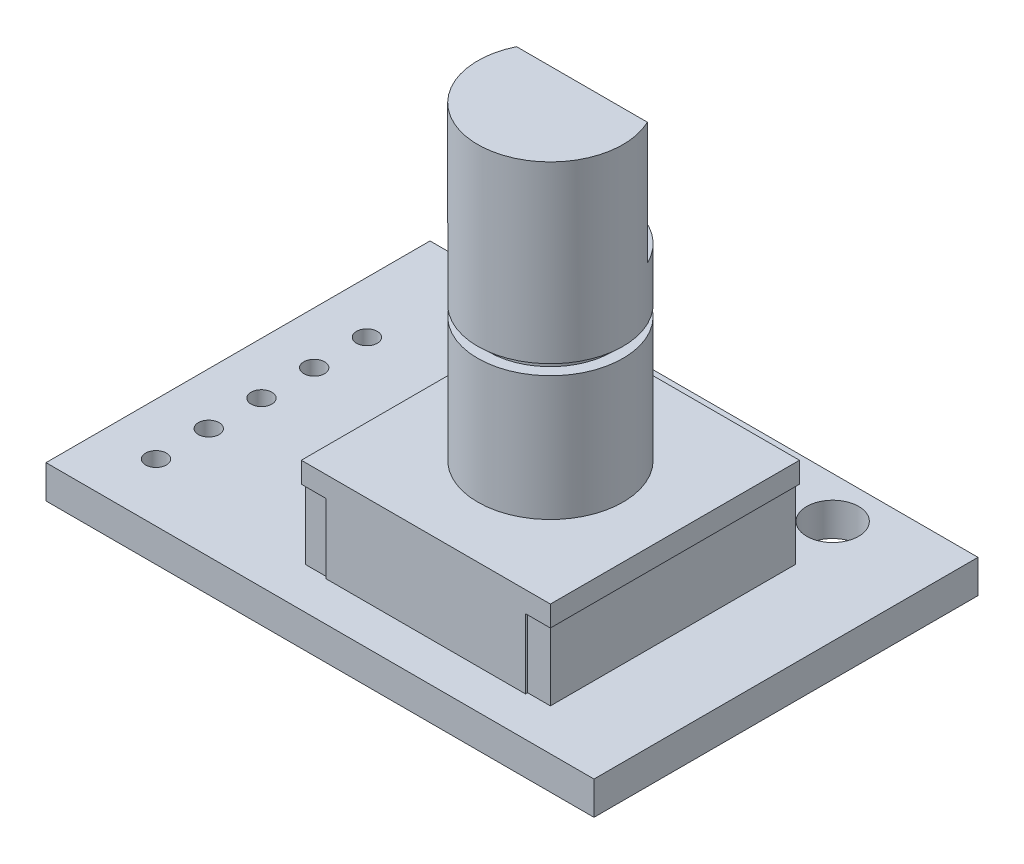
ISO-10303-21;
HEADER;
FILE_DESCRIPTION(('STEP AP214'),'2;1');
FILE_NAME('part.step','',(''),(''),'','','');
FILE_SCHEMA(('AUTOMOTIVE_DESIGN { 1 0 10303 214 1 1 1 1 }'));
ENDSEC;
DATA;
#1=APPLICATION_CONTEXT('core data for automotive mechanical design processes');
#2=APPLICATION_PROTOCOL_DEFINITION('international standard','automotive_design',2000,#1);
#3=PRODUCT_CONTEXT('',#1,'mechanical');
#4=PRODUCT('Part','Part','',(#3));
#5=PRODUCT_RELATED_PRODUCT_CATEGORY('part','',(#4));
#6=PRODUCT_DEFINITION_FORMATION('','',#4);
#7=PRODUCT_DEFINITION_CONTEXT('part definition',#1,'design');
#8=PRODUCT_DEFINITION('design','',#6,#7);
#9=PRODUCT_DEFINITION_SHAPE('','',#8);
#10=(LENGTH_UNIT() NAMED_UNIT(*) SI_UNIT(.MILLI.,.METRE.));
#11=(NAMED_UNIT(*) PLANE_ANGLE_UNIT() SI_UNIT($,.RADIAN.));
#12=(NAMED_UNIT(*) SI_UNIT($,.STERADIAN.) SOLID_ANGLE_UNIT());
#13=UNCERTAINTY_MEASURE_WITH_UNIT(LENGTH_MEASURE(1.E-05),#10,'distance_accuracy_value','');
#14=(GEOMETRIC_REPRESENTATION_CONTEXT(3) GLOBAL_UNCERTAINTY_ASSIGNED_CONTEXT((#13)) GLOBAL_UNIT_ASSIGNED_CONTEXT((#10,
#11,#12)) REPRESENTATION_CONTEXT('',''));
#15=CARTESIAN_POINT('',(0.,0.,0.));
#16=DIRECTION('',(0.,0.,1.));
#17=DIRECTION('',(1.,0.,0.));
#18=AXIS2_PLACEMENT_3D('',#15,#16,#17);
#19=CARTESIAN_POINT('',(9.19999999999999,5.95,7.35));
#20=DIRECTION('',(-1.,0.,0.));
#21=DIRECTION('',(0.,0.,1.));
#22=AXIS2_PLACEMENT_3D('',#19,#20,#21);
#23=PLANE('',#22);
#24=DIRECTION('',(0.,0.,-1.));
#25=VECTOR('',#24,1.);
#26=CARTESIAN_POINT('',(9.2,4.95,-4.65));
#27=LINE('',#26,#25);
#28=CARTESIAN_POINT('',(9.19999999999999,4.95,7.35));
#29=VERTEX_POINT('',#28);
#30=CARTESIAN_POINT('',(9.2,4.95,-4.65));
#31=VERTEX_POINT('',#30);
#32=EDGE_CURVE('E310',#29,#31,#27,.T.);
#33=ORIENTED_EDGE('',*,*,#32,.T.);
#34=DIRECTION('',(0.,-1.,0.));
#35=VECTOR('',#34,1.);
#36=CARTESIAN_POINT('',(9.2,5.95,-4.65));
#37=LINE('',#36,#35);
#38=CARTESIAN_POINT('',(9.2,5.95,-4.65));
#39=VERTEX_POINT('',#38);
#40=EDGE_CURVE('E400',#39,#31,#37,.T.);
#41=ORIENTED_EDGE('',*,*,#40,.F.);
#42=DIRECTION('',(0.,0.,-1.));
#43=VECTOR('',#42,1.);
#44=CARTESIAN_POINT('',(9.19999999999999,5.95,7.35));
#45=LINE('',#44,#43);
#46=CARTESIAN_POINT('',(9.19999999999999,5.95,7.35));
#47=VERTEX_POINT('',#46);
#48=EDGE_CURVE('E368',#47,#39,#45,.T.);
#49=ORIENTED_EDGE('',*,*,#48,.F.);
#50=DIRECTION('',(0.,-1.,0.));
#51=VECTOR('',#50,1.);
#52=CARTESIAN_POINT('',(9.19999999999999,5.95,7.35));
#53=LINE('',#52,#51);
#54=EDGE_CURVE('E382',#47,#29,#53,.T.);
#55=ORIENTED_EDGE('',*,*,#54,.T.);
#56=EDGE_LOOP('',(#33,#41,#49,#55));
#57=FACE_BOUND('',#56,.T.);
#58=ADVANCED_FACE('F41',(#57),#23,.F.);
#59=CARTESIAN_POINT('',(9.2,5.95,-4.65));
#60=DIRECTION('',(0.,0.,1.));
#61=DIRECTION('',(1.,0.,0.));
#62=AXIS2_PLACEMENT_3D('',#59,#60,#61);
#63=PLANE('',#62);
#64=DIRECTION('',(0.,-1.,0.));
#65=VECTOR('',#64,1.);
#66=CARTESIAN_POINT('',(-1.6,4.95,-4.65));
#67=LINE('',#66,#65);
#68=CARTESIAN_POINT('',(-1.6,4.95,-4.65));
#69=VERTEX_POINT('',#68);
#70=CARTESIAN_POINT('',(-1.6,1.6,-4.65));
#71=VERTEX_POINT('',#70);
#72=EDGE_CURVE('E302',#69,#71,#67,.T.);
#73=ORIENTED_EDGE('',*,*,#72,.F.);
#74=DIRECTION('',(-1.,0.,0.));
#75=VECTOR('',#74,1.);
#76=CARTESIAN_POINT('',(-1.6,4.95,-4.65));
#77=LINE('',#76,#75);
#78=CARTESIAN_POINT('',(-2.8,4.95,-4.65));
#79=VERTEX_POINT('',#78);
#80=EDGE_CURVE('E241',#69,#79,#77,.T.);
#81=ORIENTED_EDGE('',*,*,#80,.T.);
#82=DIRECTION('',(0.,-1.,0.));
#83=VECTOR('',#82,1.);
#84=CARTESIAN_POINT('',(-2.8,5.95,-4.65));
#85=LINE('',#84,#83);
#86=CARTESIAN_POINT('',(-2.8,5.95,-4.65));
#87=VERTEX_POINT('',#86);
#88=EDGE_CURVE('E396',#87,#79,#85,.T.);
#89=ORIENTED_EDGE('',*,*,#88,.F.);
#90=DIRECTION('',(-1.,0.,0.));
#91=VECTOR('',#90,1.);
#92=CARTESIAN_POINT('',(9.2,5.95,-4.65));
#93=LINE('',#92,#91);
#94=EDGE_CURVE('E372',#39,#87,#93,.T.);
#95=ORIENTED_EDGE('',*,*,#94,.F.);
#96=ORIENTED_EDGE('',*,*,#40,.T.);
#97=DIRECTION('',(-1.,0.,0.));
#98=VECTOR('',#97,1.);
#99=CARTESIAN_POINT('',(8.,4.95,-4.65));
#100=LINE('',#99,#98);
#101=CARTESIAN_POINT('',(8.,4.95,-4.65));
#102=VERTEX_POINT('',#101);
#103=EDGE_CURVE('E315',#31,#102,#100,.T.);
#104=ORIENTED_EDGE('',*,*,#103,.T.);
#105=DIRECTION('',(0.,-1.,0.));
#106=VECTOR('',#105,1.);
#107=CARTESIAN_POINT('',(8.,4.95,-4.65));
#108=LINE('',#107,#106);
#109=CARTESIAN_POINT('',(8.,1.6,-4.65));
#110=VERTEX_POINT('',#109);
#111=EDGE_CURVE('E272',#102,#110,#108,.T.);
#112=ORIENTED_EDGE('',*,*,#111,.T.);
#113=DIRECTION('',(-1.,0.,0.));
#114=VECTOR('',#113,1.);
#115=CARTESIAN_POINT('',(9.2,1.6,-4.65));
#116=LINE('',#115,#114);
#117=EDGE_CURVE('E305',#110,#71,#116,.T.);
#118=ORIENTED_EDGE('',*,*,#117,.T.);
#119=EDGE_LOOP('',(#73,#81,#89,#95,#96,#104,#112,#118));
#120=FACE_BOUND('',#119,.T.);
#121=ADVANCED_FACE('F530',(#120),#63,.F.);
#122=CARTESIAN_POINT('',(9.19999999999999,5.95,7.35));
#123=DIRECTION('',(0.,0.,-1.));
#124=DIRECTION('',(-1.,0.,0.));
#125=AXIS2_PLACEMENT_3D('',#122,#123,#124);
#126=PLANE('',#125);
#127=DIRECTION('',(0.,-1.,0.));
#128=VECTOR('',#127,1.);
#129=CARTESIAN_POINT('',(-1.6,4.95,7.35));
#130=LINE('',#129,#128);
#131=CARTESIAN_POINT('',(-1.6,4.95,7.35));
#132=VERTEX_POINT('',#131);
#133=CARTESIAN_POINT('',(-1.6,1.6,7.35));
#134=VERTEX_POINT('',#133);
#135=EDGE_CURVE('E298',#132,#134,#130,.T.);
#136=ORIENTED_EDGE('',*,*,#135,.T.);
#137=DIRECTION('',(1.,0.,0.));
#138=VECTOR('',#137,1.);
#139=CARTESIAN_POINT('',(9.19999999999999,1.6,7.35));
#140=LINE('',#139,#138);
#141=CARTESIAN_POINT('',(7.99999999999999,1.6,7.35));
#142=VERTEX_POINT('',#141);
#143=EDGE_CURVE('E373',#134,#142,#140,.T.);
#144=ORIENTED_EDGE('',*,*,#143,.T.);
#145=DIRECTION('',(0.,-1.,0.));
#146=VECTOR('',#145,1.);
#147=CARTESIAN_POINT('',(7.99999999999999,4.95,7.35));
#148=LINE('',#147,#146);
#149=CARTESIAN_POINT('',(7.99999999999999,4.95,7.35));
#150=VERTEX_POINT('',#149);
#151=EDGE_CURVE('E66',#150,#142,#148,.T.);
#152=ORIENTED_EDGE('',*,*,#151,.F.);
#153=DIRECTION('',(1.,0.,0.));
#154=VECTOR('',#153,1.);
#155=CARTESIAN_POINT('',(9.19999999999999,4.95,7.35));
#156=LINE('',#155,#154);
#157=EDGE_CURVE('E306',#150,#29,#156,.T.);
#158=ORIENTED_EDGE('',*,*,#157,.T.);
#159=ORIENTED_EDGE('',*,*,#54,.F.);
#160=DIRECTION('',(1.,0.,0.));
#161=VECTOR('',#160,1.);
#162=CARTESIAN_POINT('',(9.19999999999999,5.95,7.35));
#163=LINE('',#162,#161);
#164=CARTESIAN_POINT('',(-2.8,5.95,7.35));
#165=VERTEX_POINT('',#164);
#166=EDGE_CURVE('E379',#165,#47,#163,.T.);
#167=ORIENTED_EDGE('',*,*,#166,.F.);
#168=DIRECTION('',(0.,-1.,0.));
#169=VECTOR('',#168,1.);
#170=CARTESIAN_POINT('',(-2.8,5.95,7.35));
#171=LINE('',#170,#169);
#172=CARTESIAN_POINT('',(-2.8,4.95,7.35));
#173=VERTEX_POINT('',#172);
#174=EDGE_CURVE('E392',#165,#173,#171,.T.);
#175=ORIENTED_EDGE('',*,*,#174,.T.);
#176=DIRECTION('',(1.,0.,0.));
#177=VECTOR('',#176,1.);
#178=CARTESIAN_POINT('',(-2.8,4.95,7.35));
#179=LINE('',#178,#177);
#180=EDGE_CURVE('E250',#173,#132,#179,.T.);
#181=ORIENTED_EDGE('',*,*,#180,.T.);
#182=EDGE_LOOP('',(#136,#144,#152,#158,#159,#167,#175,#181));
#183=FACE_BOUND('',#182,.T.);
#184=ADVANCED_FACE('F521',(#183),#126,.F.);
#185=CARTESIAN_POINT('',(0.,1.6,0.));
#186=DIRECTION('',(0.,-1.,0.));
#187=DIRECTION('',(0.,0.,-1.));
#188=AXIS2_PLACEMENT_3D('',#185,#186,#187);
#189=PLANE('',#188);
#190=ORIENTED_EDGE('',*,*,#117,.F.);
#191=DIRECTION('',(0.,0.,1.));
#192=VECTOR('',#191,1.);
#193=CARTESIAN_POINT('',(8.,1.6,-4.55));
#194=LINE('',#193,#192);
#195=CARTESIAN_POINT('',(8.,1.6,-4.55));
#196=VERTEX_POINT('',#195);
#197=EDGE_CURVE('E233',#110,#196,#194,.T.);
#198=ORIENTED_EDGE('',*,*,#197,.T.);
#199=DIRECTION('',(1.,0.,0.));
#200=VECTOR('',#199,1.);
#201=CARTESIAN_POINT('',(9.1,1.6,-4.55));
#202=LINE('',#201,#200);
#203=CARTESIAN_POINT('',(9.1,1.6,-4.55));
#204=VERTEX_POINT('',#203);
#205=EDGE_CURVE('E336',#196,#204,#202,.T.);
#206=ORIENTED_EDGE('',*,*,#205,.T.);
#207=DIRECTION('',(0.,0.,1.));
#208=VECTOR('',#207,1.);
#209=CARTESIAN_POINT('',(9.09999999999999,1.6,7.25));
#210=LINE('',#209,#208);
#211=CARTESIAN_POINT('',(9.09999999999999,1.6,7.25));
#212=VERTEX_POINT('',#211);
#213=EDGE_CURVE('E339',#204,#212,#210,.T.);
#214=ORIENTED_EDGE('',*,*,#213,.T.);
#215=DIRECTION('',(-1.,0.,0.));
#216=VECTOR('',#215,1.);
#217=CARTESIAN_POINT('',(7.99999999999999,1.6,7.25));
#218=LINE('',#217,#216);
#219=CARTESIAN_POINT('',(7.99999999999999,1.6,7.25));
#220=VERTEX_POINT('',#219);
#221=EDGE_CURVE('E342',#212,#220,#218,.T.);
#222=ORIENTED_EDGE('',*,*,#221,.T.);
#223=DIRECTION('',(0.,0.,1.));
#224=VECTOR('',#223,1.);
#225=CARTESIAN_POINT('',(7.99999999999999,1.6,7.35));
#226=LINE('',#225,#224);
#227=EDGE_CURVE('E311',#220,#142,#226,.T.);
#228=ORIENTED_EDGE('',*,*,#227,.T.);
#229=ORIENTED_EDGE('',*,*,#143,.F.);
#230=DIRECTION('',(0.,0.,-1.));
#231=VECTOR('',#230,1.);
#232=CARTESIAN_POINT('',(-1.6,1.6,7.35));
#233=LINE('',#232,#231);
#234=CARTESIAN_POINT('',(-1.6,1.6,7.25));
#235=VERTEX_POINT('',#234);
#236=EDGE_CURVE('E271',#134,#235,#233,.T.);
#237=ORIENTED_EDGE('',*,*,#236,.T.);
#238=DIRECTION('',(-1.,0.,0.));
#239=VECTOR('',#238,1.);
#240=CARTESIAN_POINT('',(-1.6,1.6,7.25));
#241=LINE('',#240,#239);
#242=CARTESIAN_POINT('',(-2.7,1.6,7.25));
#243=VERTEX_POINT('',#242);
#244=EDGE_CURVE('E275',#235,#243,#241,.T.);
#245=ORIENTED_EDGE('',*,*,#244,.T.);
#246=DIRECTION('',(0.,0.,-1.));
#247=VECTOR('',#246,1.);
#248=CARTESIAN_POINT('',(-2.7,1.6,7.25));
#249=LINE('',#248,#247);
#250=CARTESIAN_POINT('',(-2.7,1.6,-4.55));
#251=VERTEX_POINT('',#250);
#252=EDGE_CURVE('E278',#243,#251,#249,.T.);
#253=ORIENTED_EDGE('',*,*,#252,.T.);
#254=DIRECTION('',(1.,0.,0.));
#255=VECTOR('',#254,1.);
#256=CARTESIAN_POINT('',(-2.7,1.6,-4.55));
#257=LINE('',#256,#255);
#258=CARTESIAN_POINT('',(-1.6,1.6,-4.55));
#259=VERTEX_POINT('',#258);
#260=EDGE_CURVE('E242',#251,#259,#257,.T.);
#261=ORIENTED_EDGE('',*,*,#260,.T.);
#262=DIRECTION('',(0.,0.,-1.));
#263=VECTOR('',#262,1.);
#264=CARTESIAN_POINT('',(-1.6,1.6,-4.55));
#265=LINE('',#264,#263);
#266=EDGE_CURVE('E267',#259,#71,#265,.T.);
#267=ORIENTED_EDGE('',*,*,#266,.T.);
#268=EDGE_LOOP('',(#190,#198,#206,#214,#222,#228,#229,#237,#245,#253,#261,#267));
#269=FACE_BOUND('',#268,.T.);
#270=CARTESIAN_POINT('',(-10.7,1.6,-3.71));
#271=DIRECTION('',(0.,1.,0.));
#272=DIRECTION('',(0.,0.,1.));
#273=AXIS2_PLACEMENT_3D('',#270,#271,#272);
#274=CIRCLE('',#273,0.500000000000001);
#275=CARTESIAN_POINT('',(-10.7,1.6,-3.21));
#276=VERTEX_POINT('',#275);
#277=EDGE_CURVE('E405',#276,#276,#274,.T.);
#278=ORIENTED_EDGE('',*,*,#277,.F.);
#279=EDGE_LOOP('',(#278));
#280=FACE_BOUND('',#279,.T.);
#281=CARTESIAN_POINT('',(-10.7,1.6,-1.17));
#282=DIRECTION('',(0.,1.,0.));
#283=DIRECTION('',(0.,0.,1.));
#284=AXIS2_PLACEMENT_3D('',#281,#282,#283);
#285=CIRCLE('',#284,0.500000000000001);
#286=CARTESIAN_POINT('',(-10.7,1.6,-0.669999999999998));
#287=VERTEX_POINT('',#286);
#288=EDGE_CURVE('E413',#287,#287,#285,.T.);
#289=ORIENTED_EDGE('',*,*,#288,.F.);
#290=EDGE_LOOP('',(#289));
#291=FACE_BOUND('',#290,.T.);
#292=CARTESIAN_POINT('',(-10.7,1.6,1.37));
#293=DIRECTION('',(0.,1.,0.));
#294=DIRECTION('',(0.,0.,1.));
#295=AXIS2_PLACEMENT_3D('',#292,#293,#294);
#296=CIRCLE('',#295,0.500000000000001);
#297=CARTESIAN_POINT('',(-10.7,1.6,1.87));
#298=VERTEX_POINT('',#297);
#299=EDGE_CURVE('E421',#298,#298,#296,.T.);
#300=ORIENTED_EDGE('',*,*,#299,.F.);
#301=EDGE_LOOP('',(#300));
#302=FACE_BOUND('',#301,.T.);
#303=CARTESIAN_POINT('',(-10.7,1.6,3.91));
#304=DIRECTION('',(0.,1.,0.));
#305=DIRECTION('',(0.,0.,1.));
#306=AXIS2_PLACEMENT_3D('',#303,#304,#305);
#307=CIRCLE('',#306,0.500000000000001);
#308=CARTESIAN_POINT('',(-10.7,1.6,4.41));
#309=VERTEX_POINT('',#308);
#310=EDGE_CURVE('E429',#309,#309,#307,.T.);
#311=ORIENTED_EDGE('',*,*,#310,.F.);
#312=EDGE_LOOP('',(#311));
#313=FACE_BOUND('',#312,.T.);
#314=CARTESIAN_POINT('',(-10.7,1.6,6.45));
#315=DIRECTION('',(0.,1.,0.));
#316=DIRECTION('',(0.,0.,1.));
#317=AXIS2_PLACEMENT_3D('',#314,#315,#316);
#318=CIRCLE('',#317,0.500000000000001);
#319=CARTESIAN_POINT('',(-10.7,1.6,6.95));
#320=VERTEX_POINT('',#319);
#321=EDGE_CURVE('E437',#320,#320,#318,.T.);
#322=ORIENTED_EDGE('',*,*,#321,.F.);
#323=EDGE_LOOP('',(#322));
#324=FACE_BOUND('',#323,.T.);
#325=CARTESIAN_POINT('',(8.2,1.6,-7.25));
#326=DIRECTION('',(0.,1.,0.));
#327=DIRECTION('',(0.,0.,1.));
#328=AXIS2_PLACEMENT_3D('',#325,#326,#327);
#329=CIRCLE('',#328,1.25);
#330=CARTESIAN_POINT('',(8.2,1.6,-6.));
#331=VERTEX_POINT('',#330);
#332=EDGE_CURVE('E445',#331,#331,#329,.T.);
#333=ORIENTED_EDGE('',*,*,#332,.F.);
#334=EDGE_LOOP('',(#333));
#335=FACE_BOUND('',#334,.T.);
#336=CARTESIAN_POINT('',(-5.80000000000001,1.6,-7.25));
#337=DIRECTION('',(0.,1.,0.));
#338=DIRECTION('',(0.,0.,1.));
#339=AXIS2_PLACEMENT_3D('',#336,#337,#338);
#340=CIRCLE('',#339,1.25);
#341=CARTESIAN_POINT('',(-5.80000000000001,1.6,-6.));
#342=VERTEX_POINT('',#341);
#343=EDGE_CURVE('E453',#342,#342,#340,.T.);
#344=ORIENTED_EDGE('',*,*,#343,.F.);
#345=EDGE_LOOP('',(#344));
#346=FACE_BOUND('',#345,.T.);
#347=DIRECTION('',(0.,0.,-1.));
#348=VECTOR('',#347,1.);
#349=CARTESIAN_POINT('',(13.2,1.6,9.25));
#350=LINE('',#349,#348);
#351=CARTESIAN_POINT('',(13.2,1.6,9.25));
#352=VERTEX_POINT('',#351);
#353=CARTESIAN_POINT('',(13.2,1.6,-9.25));
#354=VERTEX_POINT('',#353);
#355=EDGE_CURVE('E461',#352,#354,#350,.T.);
#356=ORIENTED_EDGE('',*,*,#355,.T.);
#357=DIRECTION('',(-1.,0.,0.));
#358=VECTOR('',#357,1.);
#359=CARTESIAN_POINT('',(-13.2,1.6,-9.25));
#360=LINE('',#359,#358);
#361=CARTESIAN_POINT('',(-13.2,1.6,-9.25));
#362=VERTEX_POINT('',#361);
#363=EDGE_CURVE('E465',#354,#362,#360,.T.);
#364=ORIENTED_EDGE('',*,*,#363,.T.);
#365=DIRECTION('',(0.,0.,1.));
#366=VECTOR('',#365,1.);
#367=CARTESIAN_POINT('',(-13.2,1.6,9.25));
#368=LINE('',#367,#366);
#369=CARTESIAN_POINT('',(-13.2,1.6,9.25));
#370=VERTEX_POINT('',#369);
#371=EDGE_CURVE('E469',#362,#370,#368,.T.);
#372=ORIENTED_EDGE('',*,*,#371,.T.);
#373=DIRECTION('',(1.,0.,0.));
#374=VECTOR('',#373,1.);
#375=CARTESIAN_POINT('',(-13.2,1.6,9.25));
#376=LINE('',#375,#374);
#377=EDGE_CURVE('E472',#370,#352,#376,.T.);
#378=ORIENTED_EDGE('',*,*,#377,.T.);
#379=EDGE_LOOP('',(#356,#364,#372,#378));
#380=FACE_BOUND('',#379,.T.);
#381=ADVANCED_FACE('F519',(#269,#280,#291,#302,#313,#324,#335,#346,#380),#189,.F.);
#382=CARTESIAN_POINT('',(0.,0.,0.));
#383=DIRECTION('',(0.,-1.,0.));
#384=DIRECTION('',(0.,0.,-1.));
#385=AXIS2_PLACEMENT_3D('',#382,#383,#384);
#386=PLANE('',#385);
#387=CARTESIAN_POINT('',(-10.7,0.,-1.17));
#388=DIRECTION('',(0.,1.,0.));
#389=DIRECTION('',(0.,0.,1.));
#390=AXIS2_PLACEMENT_3D('',#387,#388,#389);
#391=CIRCLE('',#390,0.500000000000001);
#392=CARTESIAN_POINT('',(-10.7,0.,-0.669999999999998));
#393=VERTEX_POINT('',#392);
#394=EDGE_CURVE('E409',#393,#393,#391,.T.);
#395=ORIENTED_EDGE('',*,*,#394,.T.);
#396=EDGE_LOOP('',(#395));
#397=FACE_BOUND('',#396,.T.);
#398=CARTESIAN_POINT('',(-10.7,0.,3.91));
#399=DIRECTION('',(0.,1.,0.));
#400=DIRECTION('',(0.,0.,1.));
#401=AXIS2_PLACEMENT_3D('',#398,#399,#400);
#402=CIRCLE('',#401,0.500000000000001);
#403=CARTESIAN_POINT('',(-10.7,0.,4.41));
#404=VERTEX_POINT('',#403);
#405=EDGE_CURVE('E425',#404,#404,#402,.T.);
#406=ORIENTED_EDGE('',*,*,#405,.T.);
#407=EDGE_LOOP('',(#406));
#408=FACE_BOUND('',#407,.T.);
#409=CARTESIAN_POINT('',(8.2,0.,-7.25));
#410=DIRECTION('',(0.,1.,0.));
#411=DIRECTION('',(0.,0.,1.));
#412=AXIS2_PLACEMENT_3D('',#409,#410,#411);
#413=CIRCLE('',#412,1.25);
#414=CARTESIAN_POINT('',(8.2,0.,-6.));
#415=VERTEX_POINT('',#414);
#416=EDGE_CURVE('E441',#415,#415,#413,.T.);
#417=ORIENTED_EDGE('',*,*,#416,.T.);
#418=EDGE_LOOP('',(#417));
#419=FACE_BOUND('',#418,.T.);
#420=DIRECTION('',(0.,0.,-1.));
#421=VECTOR('',#420,1.);
#422=CARTESIAN_POINT('',(13.2,0.,9.25));
#423=LINE('',#422,#421);
#424=CARTESIAN_POINT('',(13.2,0.,9.25));
#425=VERTEX_POINT('',#424);
#426=CARTESIAN_POINT('',(13.2,0.,-9.25));
#427=VERTEX_POINT('',#426);
#428=EDGE_CURVE('E457',#425,#427,#423,.T.);
#429=ORIENTED_EDGE('',*,*,#428,.F.);
#430=DIRECTION('',(1.,0.,0.));
#431=VECTOR('',#430,1.);
#432=CARTESIAN_POINT('',(-13.2,0.,9.25));
#433=LINE('',#432,#431);
#434=CARTESIAN_POINT('',(-13.2,0.,9.25));
#435=VERTEX_POINT('',#434);
#436=EDGE_CURVE('E466',#435,#425,#433,.T.);
#437=ORIENTED_EDGE('',*,*,#436,.F.);
#438=DIRECTION('',(0.,0.,1.));
#439=VECTOR('',#438,1.);
#440=CARTESIAN_POINT('',(-13.2,0.,9.25));
#441=LINE('',#440,#439);
#442=CARTESIAN_POINT('',(-13.2,0.,-9.25));
#443=VERTEX_POINT('',#442);
#444=EDGE_CURVE('E482',#443,#435,#441,.T.);
#445=ORIENTED_EDGE('',*,*,#444,.F.);
#446=DIRECTION('',(-1.,0.,0.));
#447=VECTOR('',#446,1.);
#448=CARTESIAN_POINT('',(-13.2,0.,-9.25));
#449=LINE('',#448,#447);
#450=EDGE_CURVE('E479',#427,#443,#449,.T.);
#451=ORIENTED_EDGE('',*,*,#450,.F.);
#452=EDGE_LOOP('',(#429,#437,#445,#451));
#453=FACE_BOUND('',#452,.T.);
#454=CARTESIAN_POINT('',(-5.80000000000001,0.,-7.25));
#455=DIRECTION('',(0.,1.,0.));
#456=DIRECTION('',(0.,0.,1.));
#457=AXIS2_PLACEMENT_3D('',#454,#455,#456);
#458=CIRCLE('',#457,1.25);
#459=CARTESIAN_POINT('',(-5.80000000000001,0.,-6.));
#460=VERTEX_POINT('',#459);
#461=EDGE_CURVE('E449',#460,#460,#458,.T.);
#462=ORIENTED_EDGE('',*,*,#461,.T.);
#463=EDGE_LOOP('',(#462));
#464=FACE_BOUND('',#463,.T.);
#465=CARTESIAN_POINT('',(-10.7,0.,6.45));
#466=DIRECTION('',(0.,1.,0.));
#467=DIRECTION('',(0.,0.,1.));
#468=AXIS2_PLACEMENT_3D('',#465,#466,#467);
#469=CIRCLE('',#468,0.500000000000001);
#470=CARTESIAN_POINT('',(-10.7,0.,6.95));
#471=VERTEX_POINT('',#470);
#472=EDGE_CURVE('E433',#471,#471,#469,.T.);
#473=ORIENTED_EDGE('',*,*,#472,.T.);
#474=EDGE_LOOP('',(#473));
#475=FACE_BOUND('',#474,.T.);
#476=CARTESIAN_POINT('',(-10.7,0.,1.37));
#477=DIRECTION('',(0.,1.,0.));
#478=DIRECTION('',(0.,0.,1.));
#479=AXIS2_PLACEMENT_3D('',#476,#477,#478);
#480=CIRCLE('',#479,0.500000000000001);
#481=CARTESIAN_POINT('',(-10.7,0.,1.87));
#482=VERTEX_POINT('',#481);
#483=EDGE_CURVE('E417',#482,#482,#480,.T.);
#484=ORIENTED_EDGE('',*,*,#483,.T.);
#485=EDGE_LOOP('',(#484));
#486=FACE_BOUND('',#485,.T.);
#487=CARTESIAN_POINT('',(-10.7,0.,-3.71));
#488=DIRECTION('',(0.,1.,0.));
#489=DIRECTION('',(0.,0.,1.));
#490=AXIS2_PLACEMENT_3D('',#487,#488,#489);
#491=CIRCLE('',#490,0.500000000000001);
#492=CARTESIAN_POINT('',(-10.7,0.,-3.21));
#493=VERTEX_POINT('',#492);
#494=EDGE_CURVE('E404',#493,#493,#491,.T.);
#495=ORIENTED_EDGE('',*,*,#494,.T.);
#496=EDGE_LOOP('',(#495));
#497=FACE_BOUND('',#496,.T.);
#498=ADVANCED_FACE('F511',(#397,#408,#419,#453,#464,#475,#486,#497),#386,.T.);
#499=CARTESIAN_POINT('',(13.2,1.6,9.25));
#500=DIRECTION('',(-1.,0.,0.));
#501=DIRECTION('',(0.,0.,1.));
#502=AXIS2_PLACEMENT_3D('',#499,#500,#501);
#503=PLANE('',#502);
#504=ORIENTED_EDGE('',*,*,#428,.T.);
#505=DIRECTION('',(0.,-1.,0.));
#506=VECTOR('',#505,1.);
#507=CARTESIAN_POINT('',(13.2,1.6,-9.25));
#508=LINE('',#507,#506);
#509=EDGE_CURVE('E45',#354,#427,#508,.T.);
#510=ORIENTED_EDGE('',*,*,#509,.F.);
#511=ORIENTED_EDGE('',*,*,#355,.F.);
#512=DIRECTION('',(0.,-1.,0.));
#513=VECTOR('',#512,1.);
#514=CARTESIAN_POINT('',(13.2,1.6,9.25));
#515=LINE('',#514,#513);
#516=EDGE_CURVE('E475',#352,#425,#515,.T.);
#517=ORIENTED_EDGE('',*,*,#516,.T.);
#518=EDGE_LOOP('',(#504,#510,#511,#517));
#519=FACE_BOUND('',#518,.T.);
#520=ADVANCED_FACE('F43',(#519),#503,.F.);
#521=CARTESIAN_POINT('',(-13.2,1.6,-9.25));
#522=DIRECTION('',(0.,0.,1.));
#523=DIRECTION('',(1.,0.,0.));
#524=AXIS2_PLACEMENT_3D('',#521,#522,#523);
#525=PLANE('',#524);
#526=ORIENTED_EDGE('',*,*,#450,.T.);
#527=DIRECTION('',(0.,-1.,0.));
#528=VECTOR('',#527,1.);
#529=CARTESIAN_POINT('',(-13.2,1.6,-9.25));
#530=LINE('',#529,#528);
#531=EDGE_CURVE('E493',#362,#443,#530,.T.);
#532=ORIENTED_EDGE('',*,*,#531,.F.);
#533=ORIENTED_EDGE('',*,*,#363,.F.);
#534=ORIENTED_EDGE('',*,*,#509,.T.);
#535=EDGE_LOOP('',(#526,#532,#533,#534));
#536=FACE_BOUND('',#535,.T.);
#537=ADVANCED_FACE('F504',(#536),#525,.F.);
#538=CARTESIAN_POINT('',(-13.2,1.6,9.25));
#539=DIRECTION('',(1.,0.,0.));
#540=DIRECTION('',(0.,0.,-1.));
#541=AXIS2_PLACEMENT_3D('',#538,#539,#540);
#542=PLANE('',#541);
#543=ORIENTED_EDGE('',*,*,#444,.T.);
#544=DIRECTION('',(0.,-1.,0.));
#545=VECTOR('',#544,1.);
#546=CARTESIAN_POINT('',(-13.2,1.6,9.25));
#547=LINE('',#546,#545);
#548=EDGE_CURVE('E490',#370,#435,#547,.T.);
#549=ORIENTED_EDGE('',*,*,#548,.F.);
#550=ORIENTED_EDGE('',*,*,#371,.F.);
#551=ORIENTED_EDGE('',*,*,#531,.T.);
#552=EDGE_LOOP('',(#543,#549,#550,#551));
#553=FACE_BOUND('',#552,.T.);
#554=ADVANCED_FACE('F514',(#553),#542,.F.);
#555=CARTESIAN_POINT('',(-13.2,1.6,9.25));
#556=DIRECTION('',(0.,0.,-1.));
#557=DIRECTION('',(-1.,0.,0.));
#558=AXIS2_PLACEMENT_3D('',#555,#556,#557);
#559=PLANE('',#558);
#560=ORIENTED_EDGE('',*,*,#436,.T.);
#561=ORIENTED_EDGE('',*,*,#516,.F.);
#562=ORIENTED_EDGE('',*,*,#377,.F.);
#563=ORIENTED_EDGE('',*,*,#548,.T.);
#564=EDGE_LOOP('',(#560,#561,#562,#563));
#565=FACE_BOUND('',#564,.T.);
#566=ADVANCED_FACE('F517',(#565),#559,.F.);
#567=CARTESIAN_POINT('',(-5.80000000000001,1.6,-7.25));
#568=DIRECTION('',(0.,-1.,0.));
#569=DIRECTION('',(0.,0.,-1.));
#570=AXIS2_PLACEMENT_3D('',#567,#568,#569);
#571=CYLINDRICAL_SURFACE('',#570,1.25);
#572=ORIENTED_EDGE('',*,*,#343,.T.);
#573=EDGE_LOOP('',(#572));
#574=FACE_BOUND('',#573,.T.);
#575=ORIENTED_EDGE('',*,*,#461,.F.);
#576=EDGE_LOOP('',(#575));
#577=FACE_BOUND('',#576,.T.);
#578=ADVANCED_FACE('F569',(#574,#577),#571,.F.);
#579=CARTESIAN_POINT('',(8.2,1.6,-7.25));
#580=DIRECTION('',(0.,-1.,0.));
#581=DIRECTION('',(0.,0.,-1.));
#582=AXIS2_PLACEMENT_3D('',#579,#580,#581);
#583=CYLINDRICAL_SURFACE('',#582,1.25);
#584=ORIENTED_EDGE('',*,*,#332,.T.);
#585=EDGE_LOOP('',(#584));
#586=FACE_BOUND('',#585,.T.);
#587=ORIENTED_EDGE('',*,*,#416,.F.);
#588=EDGE_LOOP('',(#587));
#589=FACE_BOUND('',#588,.T.);
#590=ADVANCED_FACE('F566',(#586,#589),#583,.F.);
#591=CARTESIAN_POINT('',(-10.7,1.6,6.45));
#592=DIRECTION('',(0.,-1.,0.));
#593=DIRECTION('',(0.,0.,-1.));
#594=AXIS2_PLACEMENT_3D('',#591,#592,#593);
#595=CYLINDRICAL_SURFACE('',#594,0.500000000000001);
#596=ORIENTED_EDGE('',*,*,#321,.T.);
#597=EDGE_LOOP('',(#596));
#598=FACE_BOUND('',#597,.T.);
#599=ORIENTED_EDGE('',*,*,#472,.F.);
#600=EDGE_LOOP('',(#599));
#601=FACE_BOUND('',#600,.T.);
#602=ADVANCED_FACE('F562',(#598,#601),#595,.F.);
#603=CARTESIAN_POINT('',(-10.7,1.6,3.91));
#604=DIRECTION('',(0.,-1.,0.));
#605=DIRECTION('',(0.,0.,-1.));
#606=AXIS2_PLACEMENT_3D('',#603,#604,#605);
#607=CYLINDRICAL_SURFACE('',#606,0.500000000000001);
#608=ORIENTED_EDGE('',*,*,#310,.T.);
#609=EDGE_LOOP('',(#608));
#610=FACE_BOUND('',#609,.T.);
#611=ORIENTED_EDGE('',*,*,#405,.F.);
#612=EDGE_LOOP('',(#611));
#613=FACE_BOUND('',#612,.T.);
#614=ADVANCED_FACE('F558',(#610,#613),#607,.F.);
#615=CARTESIAN_POINT('',(-10.7,1.6,1.37));
#616=DIRECTION('',(0.,-1.,0.));
#617=DIRECTION('',(0.,0.,-1.));
#618=AXIS2_PLACEMENT_3D('',#615,#616,#617);
#619=CYLINDRICAL_SURFACE('',#618,0.500000000000001);
#620=ORIENTED_EDGE('',*,*,#299,.T.);
#621=EDGE_LOOP('',(#620));
#622=FACE_BOUND('',#621,.T.);
#623=ORIENTED_EDGE('',*,*,#483,.F.);
#624=EDGE_LOOP('',(#623));
#625=FACE_BOUND('',#624,.T.);
#626=ADVANCED_FACE('F554',(#622,#625),#619,.F.);
#627=CARTESIAN_POINT('',(-10.7,1.6,-1.17));
#628=DIRECTION('',(0.,-1.,0.));
#629=DIRECTION('',(0.,0.,-1.));
#630=AXIS2_PLACEMENT_3D('',#627,#628,#629);
#631=CYLINDRICAL_SURFACE('',#630,0.500000000000001);
#632=ORIENTED_EDGE('',*,*,#288,.T.);
#633=EDGE_LOOP('',(#632));
#634=FACE_BOUND('',#633,.T.);
#635=ORIENTED_EDGE('',*,*,#394,.F.);
#636=EDGE_LOOP('',(#635));
#637=FACE_BOUND('',#636,.T.);
#638=ADVANCED_FACE('F550',(#634,#637),#631,.F.);
#639=CARTESIAN_POINT('',(-10.7,1.6,-3.71));
#640=DIRECTION('',(0.,-1.,0.));
#641=DIRECTION('',(0.,0.,-1.));
#642=AXIS2_PLACEMENT_3D('',#639,#640,#641);
#643=CYLINDRICAL_SURFACE('',#642,0.500000000000001);
#644=ORIENTED_EDGE('',*,*,#277,.T.);
#645=EDGE_LOOP('',(#644));
#646=FACE_BOUND('',#645,.T.);
#647=ORIENTED_EDGE('',*,*,#494,.F.);
#648=EDGE_LOOP('',(#647));
#649=FACE_BOUND('',#648,.T.);
#650=ADVANCED_FACE('F546',(#646,#649),#643,.F.);
#651=CARTESIAN_POINT('',(-2.8,5.95,7.35));
#652=DIRECTION('',(1.,0.,0.));
#653=DIRECTION('',(0.,0.,-1.));
#654=AXIS2_PLACEMENT_3D('',#651,#652,#653);
#655=PLANE('',#654);
#656=ORIENTED_EDGE('',*,*,#88,.T.);
#657=DIRECTION('',(0.,0.,1.));
#658=VECTOR('',#657,1.);
#659=CARTESIAN_POINT('',(-2.8,4.95,-4.65));
#660=LINE('',#659,#658);
#661=EDGE_CURVE('E246',#79,#173,#660,.T.);
#662=ORIENTED_EDGE('',*,*,#661,.T.);
#663=ORIENTED_EDGE('',*,*,#174,.F.);
#664=DIRECTION('',(0.,0.,1.));
#665=VECTOR('',#664,1.);
#666=CARTESIAN_POINT('',(-2.8,5.95,7.35));
#667=LINE('',#666,#665);
#668=EDGE_CURVE('E376',#87,#165,#667,.T.);
#669=ORIENTED_EDGE('',*,*,#668,.F.);
#670=EDGE_LOOP('',(#656,#662,#663,#669));
#671=FACE_BOUND('',#670,.T.);
#672=ADVANCED_FACE('F549',(#671),#655,.F.);
#673=CARTESIAN_POINT('',(0.,5.95,0.));
#674=DIRECTION('',(0.,1.,0.));
#675=DIRECTION('',(0.,0.,1.));
#676=AXIS2_PLACEMENT_3D('',#673,#674,#675);
#677=PLANE('',#676);
#678=CARTESIAN_POINT('',(3.2,5.95,1.35));
#679=DIRECTION('',(0.,1.,0.));
#680=DIRECTION('',(0.,0.,1.));
#681=AXIS2_PLACEMENT_3D('',#678,#679,#680);
#682=CIRCLE('',#681,3.5);
#683=CARTESIAN_POINT('',(3.2,5.95,4.85));
#684=VERTEX_POINT('',#683);
#685=EDGE_CURVE('E51',#684,#684,#682,.T.);
#686=ORIENTED_EDGE('',*,*,#685,.F.);
#687=EDGE_LOOP('',(#686));
#688=FACE_BOUND('',#687,.T.);
#689=ORIENTED_EDGE('',*,*,#48,.T.);
#690=ORIENTED_EDGE('',*,*,#94,.T.);
#691=ORIENTED_EDGE('',*,*,#668,.T.);
#692=ORIENTED_EDGE('',*,*,#166,.T.);
#693=EDGE_LOOP('',(#689,#690,#691,#692));
#694=FACE_BOUND('',#693,.T.);
#695=ADVANCED_FACE('F622',(#688,#694),#677,.T.);
#696=CARTESIAN_POINT('',(8.,4.95,-4.55));
#697=DIRECTION('',(1.,0.,0.));
#698=DIRECTION('',(0.,0.,-1.));
#699=AXIS2_PLACEMENT_3D('',#696,#697,#698);
#700=PLANE('',#699);
#701=ORIENTED_EDGE('',*,*,#197,.F.);
#702=ORIENTED_EDGE('',*,*,#111,.F.);
#703=DIRECTION('',(0.,0.,1.));
#704=VECTOR('',#703,1.);
#705=CARTESIAN_POINT('',(8.,4.95,-4.55));
#706=LINE('',#705,#704);
#707=CARTESIAN_POINT('',(8.,4.95,-4.55));
#708=VERTEX_POINT('',#707);
#709=EDGE_CURVE('E319',#102,#708,#706,.T.);
#710=ORIENTED_EDGE('',*,*,#709,.T.);
#711=DIRECTION('',(0.,-1.,0.));
#712=VECTOR('',#711,1.);
#713=CARTESIAN_POINT('',(8.,4.95,-4.55));
#714=LINE('',#713,#712);
#715=EDGE_CURVE('E361',#708,#196,#714,.T.);
#716=ORIENTED_EDGE('',*,*,#715,.T.);
#717=EDGE_LOOP('',(#701,#702,#710,#716));
#718=FACE_BOUND('',#717,.T.);
#719=ADVANCED_FACE('F627',(#718),#700,.T.);
#720=CARTESIAN_POINT('',(9.1,4.95,-4.55));
#721=DIRECTION('',(0.,0.,-1.));
#722=DIRECTION('',(-1.,0.,0.));
#723=AXIS2_PLACEMENT_3D('',#720,#721,#722);
#724=PLANE('',#723);
#725=ORIENTED_EDGE('',*,*,#205,.F.);
#726=ORIENTED_EDGE('',*,*,#715,.F.);
#727=DIRECTION('',(1.,0.,0.));
#728=VECTOR('',#727,1.);
#729=CARTESIAN_POINT('',(9.1,4.95,-4.55));
#730=LINE('',#729,#728);
#731=CARTESIAN_POINT('',(9.1,4.95,-4.55));
#732=VERTEX_POINT('',#731);
#733=EDGE_CURVE('E322',#708,#732,#730,.T.);
#734=ORIENTED_EDGE('',*,*,#733,.T.);
#735=DIRECTION('',(0.,-1.,0.));
#736=VECTOR('',#735,1.);
#737=CARTESIAN_POINT('',(9.1,4.95,-4.55));
#738=LINE('',#737,#736);
#739=EDGE_CURVE('E357',#732,#204,#738,.T.);
#740=ORIENTED_EDGE('',*,*,#739,.T.);
#741=EDGE_LOOP('',(#725,#726,#734,#740));
#742=FACE_BOUND('',#741,.T.);
#743=ADVANCED_FACE('F732',(#742),#724,.T.);
#744=CARTESIAN_POINT('',(9.09999999999999,4.95,7.25));
#745=DIRECTION('',(1.,0.,0.));
#746=DIRECTION('',(0.,0.,-1.));
#747=AXIS2_PLACEMENT_3D('',#744,#745,#746);
#748=PLANE('',#747);
#749=ORIENTED_EDGE('',*,*,#213,.F.);
#750=ORIENTED_EDGE('',*,*,#739,.F.);
#751=DIRECTION('',(0.,0.,1.));
#752=VECTOR('',#751,1.);
#753=CARTESIAN_POINT('',(9.09999999999999,4.95,7.25));
#754=LINE('',#753,#752);
#755=CARTESIAN_POINT('',(9.09999999999999,4.95,7.25));
#756=VERTEX_POINT('',#755);
#757=EDGE_CURVE('E325',#732,#756,#754,.T.);
#758=ORIENTED_EDGE('',*,*,#757,.T.);
#759=DIRECTION('',(0.,-1.,0.));
#760=VECTOR('',#759,1.);
#761=CARTESIAN_POINT('',(9.09999999999999,4.95,7.25));
#762=LINE('',#761,#760);
#763=EDGE_CURVE('E353',#756,#212,#762,.T.);
#764=ORIENTED_EDGE('',*,*,#763,.T.);
#765=EDGE_LOOP('',(#749,#750,#758,#764));
#766=FACE_BOUND('',#765,.T.);
#767=ADVANCED_FACE('F737',(#766),#748,.T.);
#768=CARTESIAN_POINT('',(7.99999999999999,4.95,7.25));
#769=DIRECTION('',(0.,0.,1.));
#770=DIRECTION('',(1.,0.,0.));
#771=AXIS2_PLACEMENT_3D('',#768,#769,#770);
#772=PLANE('',#771);
#773=ORIENTED_EDGE('',*,*,#221,.F.);
#774=ORIENTED_EDGE('',*,*,#763,.F.);
#775=DIRECTION('',(-1.,0.,0.));
#776=VECTOR('',#775,1.);
#777=CARTESIAN_POINT('',(7.99999999999999,4.95,7.25));
#778=LINE('',#777,#776);
#779=CARTESIAN_POINT('',(7.99999999999999,4.95,7.25));
#780=VERTEX_POINT('',#779);
#781=EDGE_CURVE('E328',#756,#780,#778,.T.);
#782=ORIENTED_EDGE('',*,*,#781,.T.);
#783=DIRECTION('',(0.,-1.,0.));
#784=VECTOR('',#783,1.);
#785=CARTESIAN_POINT('',(7.99999999999999,4.95,7.25));
#786=LINE('',#785,#784);
#787=EDGE_CURVE('E349',#780,#220,#786,.T.);
#788=ORIENTED_EDGE('',*,*,#787,.T.);
#789=EDGE_LOOP('',(#773,#774,#782,#788));
#790=FACE_BOUND('',#789,.T.);
#791=ADVANCED_FACE('F747',(#790),#772,.T.);
#792=CARTESIAN_POINT('',(7.99999999999999,4.95,7.35));
#793=DIRECTION('',(1.,0.,0.));
#794=DIRECTION('',(0.,0.,-1.));
#795=AXIS2_PLACEMENT_3D('',#792,#793,#794);
#796=PLANE('',#795);
#797=ORIENTED_EDGE('',*,*,#227,.F.);
#798=ORIENTED_EDGE('',*,*,#787,.F.);
#799=DIRECTION('',(0.,0.,1.));
#800=VECTOR('',#799,1.);
#801=CARTESIAN_POINT('',(7.99999999999999,4.95,7.35));
#802=LINE('',#801,#800);
#803=EDGE_CURVE('E331',#780,#150,#802,.T.);
#804=ORIENTED_EDGE('',*,*,#803,.T.);
#805=ORIENTED_EDGE('',*,*,#151,.T.);
#806=EDGE_LOOP('',(#797,#798,#804,#805));
#807=FACE_BOUND('',#806,.T.);
#808=ADVANCED_FACE('F756',(#807),#796,.T.);
#809=CARTESIAN_POINT('',(0.,4.95,0.));
#810=DIRECTION('',(0.,-1.,0.));
#811=DIRECTION('',(0.,0.,-1.));
#812=AXIS2_PLACEMENT_3D('',#809,#810,#811);
#813=PLANE('',#812);
#814=ORIENTED_EDGE('',*,*,#157,.F.);
#815=ORIENTED_EDGE('',*,*,#803,.F.);
#816=ORIENTED_EDGE('',*,*,#781,.F.);
#817=ORIENTED_EDGE('',*,*,#757,.F.);
#818=ORIENTED_EDGE('',*,*,#733,.F.);
#819=ORIENTED_EDGE('',*,*,#709,.F.);
#820=ORIENTED_EDGE('',*,*,#103,.F.);
#821=ORIENTED_EDGE('',*,*,#32,.F.);
#822=EDGE_LOOP('',(#814,#815,#816,#817,#818,#819,#820,#821));
#823=FACE_BOUND('',#822,.T.);
#824=ADVANCED_FACE('F766',(#823),#813,.T.);
#825=CARTESIAN_POINT('',(-1.6,4.95,-4.55));
#826=DIRECTION('',(-1.,0.,0.));
#827=DIRECTION('',(0.,0.,1.));
#828=AXIS2_PLACEMENT_3D('',#825,#826,#827);
#829=PLANE('',#828);
#830=ORIENTED_EDGE('',*,*,#266,.F.);
#831=DIRECTION('',(0.,-1.,0.));
#832=VECTOR('',#831,1.);
#833=CARTESIAN_POINT('',(-1.6,4.95,-4.55));
#834=LINE('',#833,#832);
#835=CARTESIAN_POINT('',(-1.6,4.95,-4.55));
#836=VERTEX_POINT('',#835);
#837=EDGE_CURVE('E266',#836,#259,#834,.T.);
#838=ORIENTED_EDGE('',*,*,#837,.F.);
#839=DIRECTION('',(0.,0.,-1.));
#840=VECTOR('',#839,1.);
#841=CARTESIAN_POINT('',(-1.6,4.95,-4.55));
#842=LINE('',#841,#840);
#843=EDGE_CURVE('E237',#836,#69,#842,.T.);
#844=ORIENTED_EDGE('',*,*,#843,.T.);
#845=ORIENTED_EDGE('',*,*,#72,.T.);
#846=EDGE_LOOP('',(#830,#838,#844,#845));
#847=FACE_BOUND('',#846,.T.);
#848=ADVANCED_FACE('F773',(#847),#829,.T.);
#849=CARTESIAN_POINT('',(-1.6,4.95,7.35));
#850=DIRECTION('',(-1.,0.,0.));
#851=DIRECTION('',(0.,0.,1.));
#852=AXIS2_PLACEMENT_3D('',#849,#850,#851);
#853=PLANE('',#852);
#854=ORIENTED_EDGE('',*,*,#236,.F.);
#855=ORIENTED_EDGE('',*,*,#135,.F.);
#856=DIRECTION('',(0.,0.,-1.));
#857=VECTOR('',#856,1.);
#858=CARTESIAN_POINT('',(-1.6,4.95,7.35));
#859=LINE('',#858,#857);
#860=CARTESIAN_POINT('',(-1.6,4.95,7.25));
#861=VERTEX_POINT('',#860);
#862=EDGE_CURVE('E254',#132,#861,#859,.T.);
#863=ORIENTED_EDGE('',*,*,#862,.T.);
#864=DIRECTION('',(0.,-1.,0.));
#865=VECTOR('',#864,1.);
#866=CARTESIAN_POINT('',(-1.6,4.95,7.25));
#867=LINE('',#866,#865);
#868=EDGE_CURVE('E294',#861,#235,#867,.T.);
#869=ORIENTED_EDGE('',*,*,#868,.T.);
#870=EDGE_LOOP('',(#854,#855,#863,#869));
#871=FACE_BOUND('',#870,.T.);
#872=ADVANCED_FACE('F717',(#871),#853,.T.);
#873=CARTESIAN_POINT('',(-1.6,4.95,7.25));
#874=DIRECTION('',(0.,0.,1.));
#875=DIRECTION('',(1.,0.,0.));
#876=AXIS2_PLACEMENT_3D('',#873,#874,#875);
#877=PLANE('',#876);
#878=ORIENTED_EDGE('',*,*,#244,.F.);
#879=ORIENTED_EDGE('',*,*,#868,.F.);
#880=DIRECTION('',(-1.,0.,0.));
#881=VECTOR('',#880,1.);
#882=CARTESIAN_POINT('',(-1.6,4.95,7.25));
#883=LINE('',#882,#881);
#884=CARTESIAN_POINT('',(-2.7,4.95,7.25));
#885=VERTEX_POINT('',#884);
#886=EDGE_CURVE('E257',#861,#885,#883,.T.);
#887=ORIENTED_EDGE('',*,*,#886,.T.);
#888=DIRECTION('',(0.,-1.,0.));
#889=VECTOR('',#888,1.);
#890=CARTESIAN_POINT('',(-2.7,4.95,7.25));
#891=LINE('',#890,#889);
#892=EDGE_CURVE('E290',#885,#243,#891,.T.);
#893=ORIENTED_EDGE('',*,*,#892,.T.);
#894=EDGE_LOOP('',(#878,#879,#887,#893));
#895=FACE_BOUND('',#894,.T.);
#896=ADVANCED_FACE('F705',(#895),#877,.T.);
#897=CARTESIAN_POINT('',(-2.7,4.95,7.25));
#898=DIRECTION('',(-1.,0.,0.));
#899=DIRECTION('',(0.,0.,1.));
#900=AXIS2_PLACEMENT_3D('',#897,#898,#899);
#901=PLANE('',#900);
#902=ORIENTED_EDGE('',*,*,#252,.F.);
#903=ORIENTED_EDGE('',*,*,#892,.F.);
#904=DIRECTION('',(0.,0.,-1.));
#905=VECTOR('',#904,1.);
#906=CARTESIAN_POINT('',(-2.7,4.95,7.25));
#907=LINE('',#906,#905);
#908=CARTESIAN_POINT('',(-2.7,4.95,-4.55));
#909=VERTEX_POINT('',#908);
#910=EDGE_CURVE('E260',#885,#909,#907,.T.);
#911=ORIENTED_EDGE('',*,*,#910,.T.);
#912=DIRECTION('',(0.,-1.,0.));
#913=VECTOR('',#912,1.);
#914=CARTESIAN_POINT('',(-2.7,4.95,-4.55));
#915=LINE('',#914,#913);
#916=EDGE_CURVE('E286',#909,#251,#915,.T.);
#917=ORIENTED_EDGE('',*,*,#916,.T.);
#918=EDGE_LOOP('',(#902,#903,#911,#917));
#919=FACE_BOUND('',#918,.T.);
#920=ADVANCED_FACE('F699',(#919),#901,.T.);
#921=CARTESIAN_POINT('',(-2.7,4.95,-4.55));
#922=DIRECTION('',(0.,0.,-1.));
#923=DIRECTION('',(-1.,0.,0.));
#924=AXIS2_PLACEMENT_3D('',#921,#922,#923);
#925=PLANE('',#924);
#926=ORIENTED_EDGE('',*,*,#260,.F.);
#927=ORIENTED_EDGE('',*,*,#916,.F.);
#928=DIRECTION('',(1.,0.,0.));
#929=VECTOR('',#928,1.);
#930=CARTESIAN_POINT('',(-2.7,4.95,-4.55));
#931=LINE('',#930,#929);
#932=EDGE_CURVE('E263',#909,#836,#931,.T.);
#933=ORIENTED_EDGE('',*,*,#932,.T.);
#934=ORIENTED_EDGE('',*,*,#837,.T.);
#935=EDGE_LOOP('',(#926,#927,#933,#934));
#936=FACE_BOUND('',#935,.T.);
#937=ADVANCED_FACE('F704',(#936),#925,.T.);
#938=CARTESIAN_POINT('',(0.,4.95,0.));
#939=DIRECTION('',(0.,1.,0.));
#940=DIRECTION('',(0.,0.,1.));
#941=AXIS2_PLACEMENT_3D('',#938,#939,#940);
#942=PLANE('',#941);
#943=ORIENTED_EDGE('',*,*,#843,.F.);
#944=ORIENTED_EDGE('',*,*,#932,.F.);
#945=ORIENTED_EDGE('',*,*,#910,.F.);
#946=ORIENTED_EDGE('',*,*,#886,.F.);
#947=ORIENTED_EDGE('',*,*,#862,.F.);
#948=ORIENTED_EDGE('',*,*,#180,.F.);
#949=ORIENTED_EDGE('',*,*,#661,.F.);
#950=ORIENTED_EDGE('',*,*,#80,.F.);
#951=EDGE_LOOP('',(#943,#944,#945,#946,#947,#948,#949,#950));
#952=FACE_BOUND('',#951,.T.);
#953=ADVANCED_FACE('F642',(#952),#942,.F.);
#954=CARTESIAN_POINT('',(3.2,11.95,1.35));
#955=DIRECTION('',(0.,-1.,0.));
#956=DIRECTION('',(0.,0.,-1.));
#957=AXIS2_PLACEMENT_3D('',#954,#955,#956);
#958=CYLINDRICAL_SURFACE('',#957,3.5);
#959=CARTESIAN_POINT('',(3.2,11.95,1.35));
#960=DIRECTION('',(0.,1.,0.));
#961=DIRECTION('',(0.,0.,1.));
#962=AXIS2_PLACEMENT_3D('',#959,#960,#961);
#963=CIRCLE('',#962,3.5);
#964=CARTESIAN_POINT('',(3.2,11.95,4.85));
#965=VERTEX_POINT('',#964);
#966=EDGE_CURVE('E228',#965,#965,#963,.T.);
#967=ORIENTED_EDGE('',*,*,#966,.F.);
#968=EDGE_LOOP('',(#967));
#969=FACE_BOUND('',#968,.T.);
#970=ORIENTED_EDGE('',*,*,#685,.T.);
#971=EDGE_LOOP('',(#970));
#972=FACE_BOUND('',#971,.T.);
#973=ADVANCED_FACE('F637',(#969,#972),#958,.T.);
#974=CARTESIAN_POINT('',(3.2,11.95,1.35));
#975=DIRECTION('',(0.,1.,0.));
#976=DIRECTION('',(0.,0.,1.));
#977=AXIS2_PLACEMENT_3D('',#974,#975,#976);
#978=PLANE('',#977);
#979=CARTESIAN_POINT('',(3.2,11.95,1.35));
#980=DIRECTION('',(0.,1.,0.));
#981=DIRECTION('',(0.,0.,1.));
#982=AXIS2_PLACEMENT_3D('',#979,#980,#981);
#983=CIRCLE('',#982,2.96709438119775);
#984=CARTESIAN_POINT('',(3.2,11.95,4.31709438119775));
#985=VERTEX_POINT('',#984);
#986=EDGE_CURVE('E11',#985,#985,#983,.T.);
#987=ORIENTED_EDGE('',*,*,#986,.F.);
#988=EDGE_LOOP('',(#987));
#989=FACE_BOUND('',#988,.T.);
#990=ORIENTED_EDGE('',*,*,#966,.T.);
#991=EDGE_LOOP('',(#990));
#992=FACE_BOUND('',#991,.T.);
#993=ADVANCED_FACE('F641',(#989,#992),#978,.T.);
#994=CARTESIAN_POINT('',(3.2,12.45,1.35));
#995=DIRECTION('',(0.,-1.,0.));
#996=DIRECTION('',(0.,0.,-1.));
#997=AXIS2_PLACEMENT_3D('',#994,#995,#996);
#998=CYLINDRICAL_SURFACE('',#997,2.96709438119775);
#999=CARTESIAN_POINT('',(3.2,12.45,1.35));
#1000=DIRECTION('',(0.,1.,0.));
#1001=DIRECTION('',(0.,0.,1.));
#1002=AXIS2_PLACEMENT_3D('',#999,#1000,#1001);
#1003=CIRCLE('',#1002,2.96709438119775);
#1004=CARTESIAN_POINT('',(3.2,12.45,4.31709438119775));
#1005=VERTEX_POINT('',#1004);
#1006=EDGE_CURVE('E224',#1005,#1005,#1003,.T.);
#1007=ORIENTED_EDGE('',*,*,#1006,.F.);
#1008=EDGE_LOOP('',(#1007));
#1009=FACE_BOUND('',#1008,.T.);
#1010=ORIENTED_EDGE('',*,*,#986,.T.);
#1011=EDGE_LOOP('',(#1010));
#1012=FACE_BOUND('',#1011,.T.);
#1013=ADVANCED_FACE('F656',(#1009,#1012),#998,.T.);
#1014=CARTESIAN_POINT('',(3.2,14.99,1.35));
#1015=DIRECTION('',(0.,-1.,0.));
#1016=DIRECTION('',(0.,0.,-1.));
#1017=AXIS2_PLACEMENT_3D('',#1014,#1015,#1016);
#1018=CYLINDRICAL_SURFACE('',#1017,3.5);
#1019=CARTESIAN_POINT('',(3.2,14.99,1.35));
#1020=DIRECTION('',(0.,1.,0.));
#1021=DIRECTION('',(0.,0.,1.));
#1022=AXIS2_PLACEMENT_3D('',#1019,#1020,#1021);
#1023=CIRCLE('',#1022,3.5);
#1024=CARTESIAN_POINT('',(6.35271311730071,14.99,-0.169999999999998));
#1025=VERTEX_POINT('',#1024);
#1026=CARTESIAN_POINT('',(0.0472868826992771,14.99,-0.169999999999999));
#1027=VERTEX_POINT('',#1026);
#1028=EDGE_CURVE('E212',#1025,#1027,#1023,.T.);
#1029=ORIENTED_EDGE('',*,*,#1028,.F.);
#1030=DIRECTION('',(0.,-1.,0.));
#1031=VECTOR('',#1030,1.);
#1032=CARTESIAN_POINT('',(6.35271311730072,20.87,-0.169999999999998));
#1033=LINE('',#1032,#1031);
#1034=CARTESIAN_POINT('',(6.35271311730072,20.87,-0.169999999999998));
#1035=VERTEX_POINT('',#1034);
#1036=EDGE_CURVE('E198',#1035,#1025,#1033,.T.);
#1037=ORIENTED_EDGE('',*,*,#1036,.F.);
#1038=CARTESIAN_POINT('',(3.2,20.87,1.35));
#1039=DIRECTION('',(0.,1.,0.));
#1040=DIRECTION('',(0.,0.,1.));
#1041=AXIS2_PLACEMENT_3D('',#1038,#1039,#1040);
#1042=CIRCLE('',#1041,3.5);
#1043=CARTESIAN_POINT('',(0.0472868826992771,20.87,-0.169999999999999));
#1044=VERTEX_POINT('',#1043);
#1045=EDGE_CURVE('E204',#1044,#1035,#1042,.T.);
#1046=ORIENTED_EDGE('',*,*,#1045,.F.);
#1047=DIRECTION('',(0.,-1.,0.));
#1048=VECTOR('',#1047,1.);
#1049=CARTESIAN_POINT('',(0.0472868826992771,20.87,-0.169999999999999));
#1050=LINE('',#1049,#1048);
#1051=EDGE_CURVE('E200',#1044,#1027,#1050,.T.);
#1052=ORIENTED_EDGE('',*,*,#1051,.T.);
#1053=EDGE_LOOP('',(#1029,#1037,#1046,#1052));
#1054=FACE_BOUND('',#1053,.T.);
#1055=CARTESIAN_POINT('',(3.2,12.45,1.35));
#1056=DIRECTION('',(0.,1.,0.));
#1057=DIRECTION('',(0.,0.,1.));
#1058=AXIS2_PLACEMENT_3D('',#1055,#1056,#1057);
#1059=CIRCLE('',#1058,3.5);
#1060=CARTESIAN_POINT('',(3.2,12.45,4.85));
#1061=VERTEX_POINT('',#1060);
#1062=EDGE_CURVE('E214',#1061,#1061,#1059,.T.);
#1063=ORIENTED_EDGE('',*,*,#1062,.T.);
#1064=EDGE_LOOP('',(#1063));
#1065=FACE_BOUND('',#1064,.T.);
#1066=ADVANCED_FACE('F210',(#1054,#1065),#1018,.T.);
#1067=CARTESIAN_POINT('',(3.2,14.99,1.35));
#1068=DIRECTION('',(0.,1.,0.));
#1069=DIRECTION('',(0.,0.,1.));
#1070=AXIS2_PLACEMENT_3D('',#1067,#1068,#1069);
#1071=PLANE('',#1070);
#1072=DIRECTION('',(-1.,0.,0.));
#1073=VECTOR('',#1072,1.);
#1074=CARTESIAN_POINT('',(0.0472868826992771,14.99,-0.169999999999999));
#1075=LINE('',#1074,#1073);
#1076=EDGE_CURVE('E58',#1025,#1027,#1075,.T.);
#1077=ORIENTED_EDGE('',*,*,#1076,.F.);
#1078=ORIENTED_EDGE('',*,*,#1028,.T.);
#1079=EDGE_LOOP('',(#1077,#1078));
#1080=FACE_BOUND('',#1079,.T.);
#1081=ADVANCED_FACE('F655',(#1080),#1071,.T.);
#1082=CARTESIAN_POINT('',(3.2,12.45,1.35));
#1083=DIRECTION('',(0.,1.,0.));
#1084=DIRECTION('',(0.,0.,1.));
#1085=AXIS2_PLACEMENT_3D('',#1082,#1083,#1084);
#1086=PLANE('',#1085);
#1087=ORIENTED_EDGE('',*,*,#1006,.T.);
#1088=EDGE_LOOP('',(#1087));
#1089=FACE_BOUND('',#1088,.T.);
#1090=ORIENTED_EDGE('',*,*,#1062,.F.);
#1091=EDGE_LOOP('',(#1090));
#1092=FACE_BOUND('',#1091,.T.);
#1093=ADVANCED_FACE('F669',(#1089,#1092),#1086,.F.);
#1094=CARTESIAN_POINT('',(0.0472868826992771,20.87,-0.169999999999999));
#1095=DIRECTION('',(0.,0.,1.));
#1096=DIRECTION('',(1.,0.,0.));
#1097=AXIS2_PLACEMENT_3D('',#1094,#1095,#1096);
#1098=PLANE('',#1097);
#1099=ORIENTED_EDGE('',*,*,#1076,.T.);
#1100=ORIENTED_EDGE('',*,*,#1051,.F.);
#1101=DIRECTION('',(-1.,0.,0.));
#1102=VECTOR('',#1101,1.);
#1103=CARTESIAN_POINT('',(0.0472868826992771,20.87,-0.169999999999999));
#1104=LINE('',#1103,#1102);
#1105=EDGE_CURVE('E194',#1035,#1044,#1104,.T.);
#1106=ORIENTED_EDGE('',*,*,#1105,.F.);
#1107=ORIENTED_EDGE('',*,*,#1036,.T.);
#1108=EDGE_LOOP('',(#1099,#1100,#1106,#1107));
#1109=FACE_BOUND('',#1108,.T.);
#1110=ADVANCED_FACE('F196',(#1109),#1098,.F.);
#1111=CARTESIAN_POINT('',(3.2,20.87,1.35));
#1112=DIRECTION('',(0.,1.,0.));
#1113=DIRECTION('',(0.,0.,1.));
#1114=AXIS2_PLACEMENT_3D('',#1111,#1112,#1113);
#1115=PLANE('',#1114);
#1116=ORIENTED_EDGE('',*,*,#1045,.T.);
#1117=ORIENTED_EDGE('',*,*,#1105,.T.);
#1118=EDGE_LOOP('',(#1116,#1117));
#1119=FACE_BOUND('',#1118,.T.);
#1120=ADVANCED_FACE('F206',(#1119),#1115,.T.);
#1121=CLOSED_SHELL('',(#58,#121,#184,#381,#498,#520,#537,#554,#566,#578,#590,#602,#614,#626,
#638,#650,#672,#695,#719,#743,#767,#791,#808,#824,#848,#872,#896,#920,#937,#953,#973,#993,#1013,
#1066,#1081,#1093,#1110,#1120));
#1122=MANIFOLD_SOLID_BREP('B2',#1121);
#1123=ADVANCED_BREP_SHAPE_REPRESENTATION('',(#18,#1122),#14);
#1124=SHAPE_DEFINITION_REPRESENTATION(#9,#1123);
ENDSEC;
END-ISO-10303-21;
